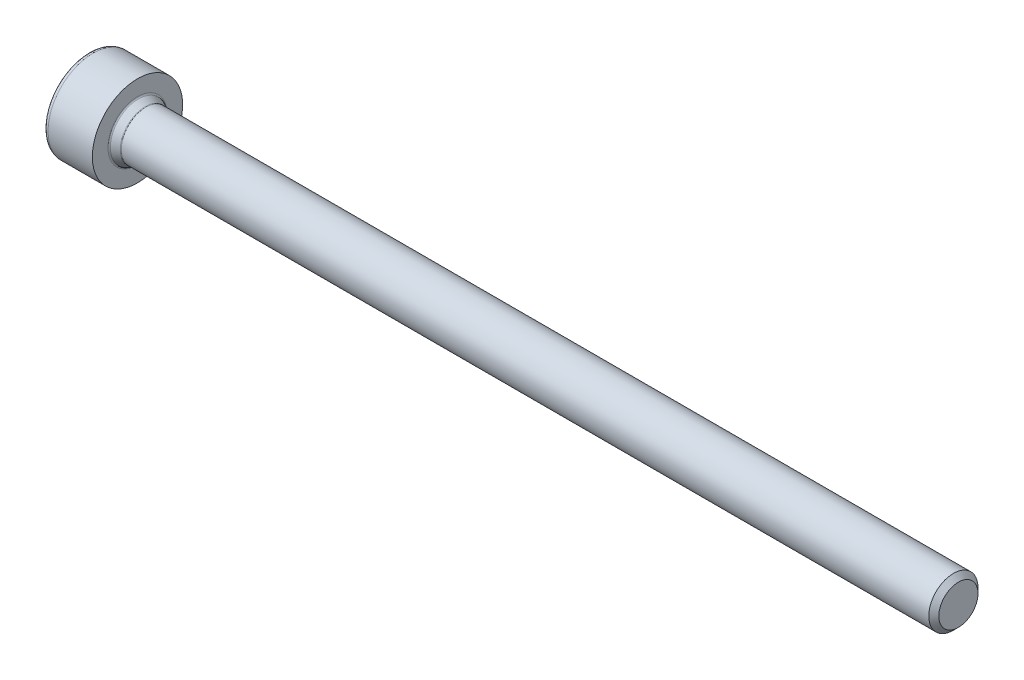
ISO-10303-21;
HEADER;
FILE_DESCRIPTION(('STEP AP214'),'2;1');
FILE_NAME('part.step','',(''),(''),'','','');
FILE_SCHEMA(('AUTOMOTIVE_DESIGN { 1 0 10303 214 1 1 1 1 }'));
ENDSEC;
DATA;
#1=APPLICATION_CONTEXT('core data for automotive mechanical design processes');
#2=APPLICATION_PROTOCOL_DEFINITION('international standard','automotive_design',2000,#1);
#3=PRODUCT_CONTEXT('',#1,'mechanical');
#4=PRODUCT('Part','Part','',(#3));
#5=PRODUCT_RELATED_PRODUCT_CATEGORY('part','',(#4));
#6=PRODUCT_DEFINITION_FORMATION('','',#4);
#7=PRODUCT_DEFINITION_CONTEXT('part definition',#1,'design');
#8=PRODUCT_DEFINITION('design','',#6,#7);
#9=PRODUCT_DEFINITION_SHAPE('','',#8);
#10=(LENGTH_UNIT() NAMED_UNIT(*) SI_UNIT(.MILLI.,.METRE.));
#11=(NAMED_UNIT(*) PLANE_ANGLE_UNIT() SI_UNIT($,.RADIAN.));
#12=(NAMED_UNIT(*) SI_UNIT($,.STERADIAN.) SOLID_ANGLE_UNIT());
#13=UNCERTAINTY_MEASURE_WITH_UNIT(LENGTH_MEASURE(1.E-05),#10,'distance_accuracy_value','');
#14=(GEOMETRIC_REPRESENTATION_CONTEXT(3) GLOBAL_UNCERTAINTY_ASSIGNED_CONTEXT((#13)) GLOBAL_UNIT_ASSIGNED_CONTEXT((#10,
#11,#12)) REPRESENTATION_CONTEXT('',''));
#15=CARTESIAN_POINT('',(0.,0.,0.));
#16=DIRECTION('',(0.,0.,1.));
#17=DIRECTION('',(1.,0.,0.));
#18=AXIS2_PLACEMENT_3D('',#15,#16,#17);
#19=CARTESIAN_POINT('',(-1.15,0.,0.));
#20=DIRECTION('',(1.,0.,0.));
#21=DIRECTION('',(0.,0.,-1.));
#22=AXIS2_PLACEMENT_3D('',#19,#20,#21);
#23=PLANE('',#22);
#24=DIRECTION('',(0.,1.,0.));
#25=VECTOR('',#24,1.);
#26=CARTESIAN_POINT('',(-1.15,0.721687836487032,1.25));
#27=LINE('',#26,#25);
#28=CARTESIAN_POINT('',(-1.15000000000217,0.,1.24999999998522));
#29=VERTEX_POINT('',#28);
#30=CARTESIAN_POINT('',(-1.15,0.721687836487032,1.25));
#31=VERTEX_POINT('',#30);
#32=EDGE_CURVE('E116',#29,#31,#27,.T.);
#33=ORIENTED_EDGE('',*,*,#32,.T.);
#34=DIRECTION('',(0.,-0.5,0.866025403784439));
#35=VECTOR('',#34,1.);
#36=CARTESIAN_POINT('',(-1.15,1.44337567297406,0.));
#37=LINE('',#36,#35);
#38=CARTESIAN_POINT('',(-1.15000000000217,1.08253175471775,0.624999999992611));
#39=VERTEX_POINT('',#38);
#40=EDGE_CURVE('E386',#31,#39,#37,.F.);
#41=ORIENTED_EDGE('',*,*,#40,.T.);
#42=CARTESIAN_POINT('',(-1.15000000000434,0.,0.));
#43=DIRECTION('',(-1.,0.,0.));
#44=DIRECTION('',(0.,0.,1.));
#45=AXIS2_PLACEMENT_3D('',#42,#43,#44);
#46=CIRCLE('',#45,1.24999999997044);
#47=EDGE_CURVE('E138',#29,#39,#46,.T.);
#48=ORIENTED_EDGE('',*,*,#47,.F.);
#49=EDGE_LOOP('',(#33,#41,#48));
#50=FACE_BOUND('',#49,.T.);
#51=ADVANCED_FACE('F16',(#50),#23,.F.);
#52=CARTESIAN_POINT('',(-1.15,0.,0.));
#53=DIRECTION('',(1.,0.,0.));
#54=DIRECTION('',(0.,0.,-1.));
#55=AXIS2_PLACEMENT_3D('',#52,#53,#54);
#56=PLANE('',#55);
#57=DIRECTION('',(0.,-0.5,-0.866025403784439));
#58=VECTOR('',#57,1.);
#59=CARTESIAN_POINT('',(-1.15,-0.721687836487032,1.25));
#60=LINE('',#59,#58);
#61=CARTESIAN_POINT('',(-1.15000000000217,-1.08253175471775,0.62499999999261));
#62=VERTEX_POINT('',#61);
#63=CARTESIAN_POINT('',(-1.15,-0.721687836487032,1.25));
#64=VERTEX_POINT('',#63);
#65=EDGE_CURVE('E364',#62,#64,#60,.F.);
#66=ORIENTED_EDGE('',*,*,#65,.T.);
#67=DIRECTION('',(0.,1.,0.));
#68=VECTOR('',#67,1.);
#69=CARTESIAN_POINT('',(-1.15,0.721687836487032,1.25));
#70=LINE('',#69,#68);
#71=EDGE_CURVE('E397',#64,#29,#70,.T.);
#72=ORIENTED_EDGE('',*,*,#71,.T.);
#73=CARTESIAN_POINT('',(-1.15000000000434,0.,0.));
#74=DIRECTION('',(-1.,0.,0.));
#75=DIRECTION('',(0.,0.,1.));
#76=AXIS2_PLACEMENT_3D('',#73,#74,#75);
#77=CIRCLE('',#76,1.24999999997044);
#78=EDGE_CURVE('E520',#62,#29,#77,.T.);
#79=ORIENTED_EDGE('',*,*,#78,.F.);
#80=EDGE_LOOP('',(#66,#72,#79));
#81=FACE_BOUND('',#80,.T.);
#82=ADVANCED_FACE('F518',(#81),#56,.F.);
#83=CARTESIAN_POINT('',(-1.15,0.721687836487032,1.25));
#84=DIRECTION('',(0.,0.,1.));
#85=DIRECTION('',(1.,0.,0.));
#86=AXIS2_PLACEMENT_3D('',#83,#84,#85);
#87=PLANE('',#86);
#88=DIRECTION('',(0.,1.,0.));
#89=VECTOR('',#88,1.);
#90=CARTESIAN_POINT('',(-3.,0.721687836487032,1.25));
#91=LINE('',#90,#89);
#92=CARTESIAN_POINT('',(-3.,0.721687836487032,1.25));
#93=VERTEX_POINT('',#92);
#94=CARTESIAN_POINT('',(-2.99999999999295,0.704787201971731,1.25));
#95=VERTEX_POINT('',#94);
#96=EDGE_CURVE('E101',#93,#95,#91,.F.);
#97=ORIENTED_EDGE('',*,*,#96,.F.);
#98=DIRECTION('',(1.,0.,0.));
#99=VECTOR('',#98,1.);
#100=CARTESIAN_POINT('',(-1.15,0.721687836487032,1.25));
#101=LINE('',#100,#99);
#102=EDGE_CURVE('E130',#93,#31,#101,.T.);
#103=ORIENTED_EDGE('',*,*,#102,.T.);
#104=ORIENTED_EDGE('',*,*,#32,.F.);
#105=ORIENTED_EDGE('',*,*,#71,.F.);
#106=DIRECTION('',(1.,0.,0.));
#107=VECTOR('',#106,1.);
#108=CARTESIAN_POINT('',(-1.15,-0.721687836487032,1.25));
#109=LINE('',#108,#107);
#110=CARTESIAN_POINT('',(-3.,-0.721687836487032,1.25));
#111=VERTEX_POINT('',#110);
#112=EDGE_CURVE('E353',#64,#111,#109,.F.);
#113=ORIENTED_EDGE('',*,*,#112,.T.);
#114=DIRECTION('',(0.,1.,0.));
#115=VECTOR('',#114,1.);
#116=CARTESIAN_POINT('',(-3.,0.721687836487032,1.25));
#117=LINE('',#116,#115);
#118=CARTESIAN_POINT('',(-2.99999999998205,-0.704787201949539,1.25));
#119=VERTEX_POINT('',#118);
#120=EDGE_CURVE('E126',#119,#111,#117,.F.);
#121=ORIENTED_EDGE('',*,*,#120,.F.);
#122=CARTESIAN_POINT('',(-2.99999999997783,0.704787201940949,1.25));
#123=CARTESIAN_POINT('',(-2.97628521463078,0.656463620376796,1.25));
#124=CARTESIAN_POINT('',(-2.95399453159109,0.607346612487099,1.25));
#125=CARTESIAN_POINT('',(-2.91320818106702,0.50722905890054,1.25));
#126=CARTESIAN_POINT('',(-2.89473623110118,0.456218934082642,1.25));
#127=CARTESIAN_POINT('',(-2.86290698911908,0.352798361194839,1.25));
#128=CARTESIAN_POINT('',(-2.84953056234284,0.300393958647145,1.25));
#129=CARTESIAN_POINT('',(-2.82898027873832,0.194487441725681,1.25));
#130=CARTESIAN_POINT('',(-2.82178823974678,0.140989021878624,1.25));
#131=CARTESIAN_POINT('',(-2.81703078816066,0.0727567227844202,1.25));
#132=CARTESIAN_POINT('',(-2.81627010165245,0.0582126032396365,1.25));
#133=CARTESIAN_POINT('',(-2.81525458538961,0.0291129972132385,1.25));
#134=CARTESIAN_POINT('',(-2.81499952617929,0.014557518887728,1.25));
#135=CARTESIAN_POINT('',(-2.8150012347011,-0.0379377877025189,1.25));
#136=CARTESIAN_POINT('',(-2.81673793609719,-0.0758894339973961,1.25));
#137=CARTESIAN_POINT('',(-2.82358164399023,-0.151496586555986,1.25));
#138=CARTESIAN_POINT('',(-2.82869102648729,-0.189151865095187,1.25));
#139=CARTESIAN_POINT('',(-2.8487554678,-0.301599972661582,1.25));
#140=CARTESIAN_POINT('',(-2.86844359296393,-0.375574474615493,1.25));
#141=CARTESIAN_POINT('',(-2.90770920227286,-0.492061542976807,1.25));
#142=CARTESIAN_POINT('',(-2.92436216211905,-0.535638893490145,1.25));
#143=CARTESIAN_POINT('',(-2.96033907938831,-0.62124460112848,1.25));
#144=CARTESIAN_POINT('',(-2.97963888445316,-0.663283043120013,1.25));
#145=CARTESIAN_POINT('',(-2.9999999999782,-0.704787201941698,1.25));
#146=B_SPLINE_CURVE_WITH_KNOTS('',3,(#122,#123,#124,#125,#126,#127,#128,#129,#130,#131,#132,
#133,#134,#135,#136,#137,#138,#139,#140,#141,#142,#143,#144,#145),.UNSPECIFIED.,.F.,.F.,(4,2,2,
2,2,2,2,2,2,2,2,4),(0.,0.161592976400067,0.324161275584256,0.486112933094178,0.64758680702521,
0.691272786946022,0.734938937452249,0.848735605721592,0.962612527612491,1.19125625258041,
1.33113310641346,1.46980937840027),.UNSPECIFIED.);
#147=EDGE_CURVE('E19',#95,#119,#146,.T.);
#148=ORIENTED_EDGE('',*,*,#147,.F.);
#149=EDGE_LOOP('',(#97,#103,#104,#105,#113,#121,#148));
#150=FACE_BOUND('',#149,.T.);
#151=ADVANCED_FACE('F124',(#150),#87,.F.);
#152=CARTESIAN_POINT('',(-1.15,1.44337567297406,0.));
#153=DIRECTION('',(0.,0.866025403784439,0.5));
#154=DIRECTION('',(0.,-0.5,0.866025403784439));
#155=AXIS2_PLACEMENT_3D('',#152,#153,#154);
#156=PLANE('',#155);
#157=DIRECTION('',(1.,0.,0.));
#158=VECTOR('',#157,1.);
#159=CARTESIAN_POINT('',(-1.15,1.44337567297406,0.));
#160=LINE('',#159,#158);
#161=CARTESIAN_POINT('',(-3.,1.44337567297406,0.));
#162=VERTEX_POINT('',#161);
#163=CARTESIAN_POINT('',(-1.15,1.44337567297406,0.));
#164=VERTEX_POINT('',#163);
#165=EDGE_CURVE('E344',#162,#164,#160,.T.);
#166=ORIENTED_EDGE('',*,*,#165,.T.);
#167=DIRECTION('',(0.,-0.5,0.866025403784439));
#168=VECTOR('',#167,1.);
#169=CARTESIAN_POINT('',(-1.15,1.44337567297406,0.));
#170=LINE('',#169,#168);
#171=EDGE_CURVE('E374',#164,#39,#170,.T.);
#172=ORIENTED_EDGE('',*,*,#171,.T.);
#173=ORIENTED_EDGE('',*,*,#40,.F.);
#174=ORIENTED_EDGE('',*,*,#102,.F.);
#175=DIRECTION('',(0.,-0.5,0.866025403784439));
#176=VECTOR('',#175,1.);
#177=CARTESIAN_POINT('',(-3.,1.44337567297406,0.));
#178=LINE('',#177,#176);
#179=CARTESIAN_POINT('',(-2.99999999998205,0.730138153755779,1.23536362115045));
#180=VERTEX_POINT('',#179);
#181=EDGE_CURVE('E111',#180,#93,#178,.T.);
#182=ORIENTED_EDGE('',*,*,#181,.F.);
#183=CARTESIAN_POINT('',(-2.9999999999782,1.4349253557014,0.0146363788563366));
#184=CARTESIAN_POINT('',(-2.9762852146311,1.4107635649193,0.0564858280927792));
#185=CARTESIAN_POINT('',(-2.95399453159138,1.38620506097443,0.099022404683175));
#186=CARTESIAN_POINT('',(-2.91320818106724,1.3361462841811,0.185726749453963));
#187=CARTESIAN_POINT('',(-2.89473623110136,1.31064122177213,0.229902813396519));
#188=CARTESIAN_POINT('',(-2.86290698911919,1.25893093532818,0.319467656791381));
#189=CARTESIAN_POINT('',(-2.84953056234293,1.23272873405431,0.364851200667875));
#190=CARTESIAN_POINT('',(-2.82898027873836,1.17977547559352,0.456568934748281));
#191=CARTESIAN_POINT('',(-2.8217882397468,1.15302626566997,0.502899925398206));
#192=CARTESIAN_POINT('',(-2.81703078816067,1.11891011612282,0.561990829772475));
#193=CARTESIAN_POINT('',(-2.81627010165245,1.11163805635042,0.574586406773958));
#194=CARTESIAN_POINT('',(-2.81525458538961,1.09708825333719,0.599787404832984));
#195=CARTESIAN_POINT('',(-2.81499952617929,1.08981051417443,0.612392818827132));
#196=CARTESIAN_POINT('',(-2.8150012347011,1.06356286087929,0.657855087913762));
#197=CARTESIAN_POINT('',(-2.81673793609719,1.04458703773185,0.690722177720568));
#198=CARTESIAN_POINT('',(-2.82358164399023,1.00678346145256,0.756199892544112));
#199=CARTESIAN_POINT('',(-2.82869102648729,0.987955822182955,0.788810320345639));
#200=CARTESIAN_POINT('',(-2.8487554678,0.931731768399757,0.886193238105623));
#201=CARTESIAN_POINT('',(-2.86844359296393,0.894744517422802,0.950257036030011));
#202=CARTESIAN_POINT('',(-2.90770920227286,0.836500983242145,1.05113779644328));
#203=CARTESIAN_POINT('',(-2.92436216211905,0.814712307985476,1.08887688901745));
#204=CARTESIAN_POINT('',(-2.96033907938831,0.771909454166308,1.16301360654119));
#205=CARTESIAN_POINT('',(-2.97963888445316,0.750890233170542,1.19941996524138));
#206=CARTESIAN_POINT('',(-2.9999999999782,0.7301381537597,1.23536362114366));
#207=B_SPLINE_CURVE_WITH_KNOTS('',3,(#183,#184,#185,#186,#187,#188,#189,#190,#191,#192,#193,
#194,#195,#196,#197,#198,#199,#200,#201,#202,#203,#204,#205,#206),.UNSPECIFIED.,.F.,.F.,(4,2,2,
2,2,2,2,2,2,2,2,4),(0.,0.161592976400233,0.324161275584591,0.486112933094683,0.647586807025883,
0.691272786946774,0.734938937453082,0.848735605722425,0.962612527613324,1.19125625258124,
1.33113310641429,1.4698093784011),.UNSPECIFIED.);
#208=CARTESIAN_POINT('',(-2.99999999999295,1.43492535571641,0.0146363788303264));
#209=VERTEX_POINT('',#208);
#210=EDGE_CURVE('E127',#209,#180,#207,.T.);
#211=ORIENTED_EDGE('',*,*,#210,.F.);
#212=DIRECTION('',(0.,-0.5,0.866025403784439));
#213=VECTOR('',#212,1.);
#214=CARTESIAN_POINT('',(-3.,1.44337567297406,0.));
#215=LINE('',#214,#213);
#216=EDGE_CURVE('E377',#162,#209,#215,.T.);
#217=ORIENTED_EDGE('',*,*,#216,.F.);
#218=EDGE_LOOP('',(#166,#172,#173,#174,#182,#211,#217));
#219=FACE_BOUND('',#218,.T.);
#220=ADVANCED_FACE('F140',(#219),#156,.F.);
#221=CARTESIAN_POINT('',(-1.15,0.,0.));
#222=DIRECTION('',(1.,0.,0.));
#223=DIRECTION('',(0.,0.,-1.));
#224=AXIS2_PLACEMENT_3D('',#221,#222,#223);
#225=PLANE('',#224);
#226=ORIENTED_EDGE('',*,*,#171,.F.);
#227=DIRECTION('',(0.,0.5,0.866025403784439));
#228=VECTOR('',#227,1.);
#229=CARTESIAN_POINT('',(-1.15,0.721687836487032,-1.25));
#230=LINE('',#229,#228);
#231=CARTESIAN_POINT('',(-1.15000000000217,1.08253175471775,-0.62499999999261));
#232=VERTEX_POINT('',#231);
#233=EDGE_CURVE('E339',#164,#232,#230,.F.);
#234=ORIENTED_EDGE('',*,*,#233,.T.);
#235=CARTESIAN_POINT('',(-1.15000000000434,0.,0.));
#236=DIRECTION('',(-1.,0.,0.));
#237=DIRECTION('',(0.,0.,1.));
#238=AXIS2_PLACEMENT_3D('',#235,#236,#237);
#239=CIRCLE('',#238,1.24999999997044);
#240=EDGE_CURVE('E526',#39,#232,#239,.T.);
#241=ORIENTED_EDGE('',*,*,#240,.F.);
#242=EDGE_LOOP('',(#226,#234,#241));
#243=FACE_BOUND('',#242,.T.);
#244=ADVANCED_FACE('F193',(#243),#225,.F.);
#245=CARTESIAN_POINT('',(-0.428312163535338,0.,0.));
#246=DIRECTION('',(-1.,0.,0.));
#247=DIRECTION('',(0.,0.,1.));
#248=AXIS2_PLACEMENT_3D('',#245,#246,#247);
#249=CONICAL_SURFACE('',#248,0.,1.04719755119718);
#250=CARTESIAN_POINT('',(-0.428312163478495,0.,8.5265128291212E-11));
#251=VERTEX_POINT('',#250);
#252=VERTEX_LOOP('',#251);
#253=FACE_BOUND('',#252,.T.);
#254=CARTESIAN_POINT('',(-1.15000000000434,0.,0.));
#255=DIRECTION('',(-1.,0.,0.));
#256=DIRECTION('',(0.,0.,1.));
#257=AXIS2_PLACEMENT_3D('',#254,#255,#256);
#258=CIRCLE('',#257,1.24999999997044);
#259=CARTESIAN_POINT('',(-1.15000000000217,-1.08253175471775,-0.62499999999261));
#260=VERTEX_POINT('',#259);
#261=EDGE_CURVE('E525',#260,#62,#258,.T.);
#262=ORIENTED_EDGE('',*,*,#261,.T.);
#263=ORIENTED_EDGE('',*,*,#78,.T.);
#264=ORIENTED_EDGE('',*,*,#47,.T.);
#265=ORIENTED_EDGE('',*,*,#240,.T.);
#266=CARTESIAN_POINT('',(-1.15000000000434,0.,0.));
#267=DIRECTION('',(-1.,0.,0.));
#268=DIRECTION('',(0.,0.,1.));
#269=AXIS2_PLACEMENT_3D('',#266,#267,#268);
#270=CIRCLE('',#269,1.24999999997044);
#271=CARTESIAN_POINT('',(-1.15000000000217,0.,-1.24999999998522));
#272=VERTEX_POINT('',#271);
#273=EDGE_CURVE('E167',#232,#272,#270,.T.);
#274=ORIENTED_EDGE('',*,*,#273,.T.);
#275=CARTESIAN_POINT('',(-1.15000000000434,0.,0.));
#276=DIRECTION('',(-1.,0.,0.));
#277=DIRECTION('',(0.,0.,1.));
#278=AXIS2_PLACEMENT_3D('',#275,#276,#277);
#279=CIRCLE('',#278,1.24999999997044);
#280=EDGE_CURVE('E461',#272,#260,#279,.T.);
#281=ORIENTED_EDGE('',*,*,#280,.T.);
#282=EDGE_LOOP('',(#262,#263,#264,#265,#274,#281));
#283=FACE_BOUND('',#282,.T.);
#284=ADVANCED_FACE('F190',(#253,#283),#249,.F.);
#285=CARTESIAN_POINT('',(-1.15,0.,0.));
#286=DIRECTION('',(1.,0.,0.));
#287=DIRECTION('',(0.,0.,-1.));
#288=AXIS2_PLACEMENT_3D('',#285,#286,#287);
#289=PLANE('',#288);
#290=DIRECTION('',(0.,0.5,-0.866025403784439));
#291=VECTOR('',#290,1.);
#292=CARTESIAN_POINT('',(-1.15,-1.44337567297406,0.));
#293=LINE('',#292,#291);
#294=CARTESIAN_POINT('',(-1.15,-1.44337567297406,0.));
#295=VERTEX_POINT('',#294);
#296=EDGE_CURVE('E315',#260,#295,#293,.F.);
#297=ORIENTED_EDGE('',*,*,#296,.T.);
#298=DIRECTION('',(0.,-0.5,-0.866025403784439));
#299=VECTOR('',#298,1.);
#300=CARTESIAN_POINT('',(-1.15,-0.721687836487032,1.25));
#301=LINE('',#300,#299);
#302=EDGE_CURVE('E359',#295,#62,#301,.F.);
#303=ORIENTED_EDGE('',*,*,#302,.T.);
#304=ORIENTED_EDGE('',*,*,#261,.F.);
#305=EDGE_LOOP('',(#297,#303,#304));
#306=FACE_BOUND('',#305,.T.);
#307=ADVANCED_FACE('F186',(#306),#289,.F.);
#308=CARTESIAN_POINT('',(-1.15,-0.721687836487032,1.25));
#309=DIRECTION('',(0.,-0.866025403784439,0.5));
#310=DIRECTION('',(0.,-0.5,-0.866025403784439));
#311=AXIS2_PLACEMENT_3D('',#308,#309,#310);
#312=PLANE('',#311);
#313=ORIENTED_EDGE('',*,*,#112,.F.);
#314=ORIENTED_EDGE('',*,*,#65,.F.);
#315=ORIENTED_EDGE('',*,*,#302,.F.);
#316=DIRECTION('',(1.,0.,0.));
#317=VECTOR('',#316,1.);
#318=CARTESIAN_POINT('',(-1.15,-1.44337567297406,0.));
#319=LINE('',#318,#317);
#320=CARTESIAN_POINT('',(-3.,-1.44337567297406,0.));
#321=VERTEX_POINT('',#320);
#322=EDGE_CURVE('E303',#295,#321,#319,.F.);
#323=ORIENTED_EDGE('',*,*,#322,.T.);
#324=DIRECTION('',(0.,-0.5,-0.866025403784439));
#325=VECTOR('',#324,1.);
#326=CARTESIAN_POINT('',(-3.,-0.721687836487032,1.25));
#327=LINE('',#326,#325);
#328=CARTESIAN_POINT('',(-2.99999999998205,-1.43492535570532,0.0146363788495459));
#329=VERTEX_POINT('',#328);
#330=EDGE_CURVE('E356',#329,#321,#327,.T.);
#331=ORIENTED_EDGE('',*,*,#330,.F.);
#332=CARTESIAN_POINT('',(-2.99999999997783,-0.730138153760074,1.23536362114302));
#333=CARTESIAN_POINT('',(-2.97628521463078,-0.75429994454215,1.19351417190661));
#334=CARTESIAN_POINT('',(-2.95399453159109,-0.778858448486999,1.15097759531625));
#335=CARTESIAN_POINT('',(-2.91320818106702,-0.828917225280278,1.06427325054554));
#336=CARTESIAN_POINT('',(-2.89473623110118,-0.854422287689228,1.02009718660303));
#337=CARTESIAN_POINT('',(-2.86290698911908,-0.906132574133129,0.930532343208248));
#338=CARTESIAN_POINT('',(-2.84953056234284,-0.932334775406976,0.885148799331799));
#339=CARTESIAN_POINT('',(-2.82898027873832,-0.985288033867708,0.793431065251485));
#340=CARTESIAN_POINT('',(-2.82178823974678,-1.01203724379124,0.747100074601607));
#341=CARTESIAN_POINT('',(-2.81703078816066,-1.04615339333834,0.688009170227409));
#342=CARTESIAN_POINT('',(-2.81627010165245,-1.05342545311073,0.675413593225949));
#343=CARTESIAN_POINT('',(-2.81525458538961,-1.06797525612393,0.65021259516697));
#344=CARTESIAN_POINT('',(-2.81499952617929,-1.07525299528668,0.637607181172844));
#345=CARTESIAN_POINT('',(-2.8150012347011,-1.10150064858181,0.592144912086237));
#346=CARTESIAN_POINT('',(-2.81673793609719,-1.12047647172925,0.559277822279432));
#347=CARTESIAN_POINT('',(-2.82358164399023,-1.15828004800854,0.493800107455888));
#348=CARTESIAN_POINT('',(-2.82869102648729,-1.17710768727814,0.46118967965436));
#349=CARTESIAN_POINT('',(-2.8487554678,-1.23333174106134,0.363806761894377));
#350=CARTESIAN_POINT('',(-2.86844359296393,-1.2703189920383,0.299742963969988));
#351=CARTESIAN_POINT('',(-2.90770920227286,-1.32856252621895,0.198862203556716));
#352=CARTESIAN_POINT('',(-2.92436216211905,-1.35035120147562,0.161123110982547));
#353=CARTESIAN_POINT('',(-2.96033907938831,-1.39315405529479,0.0869863934588053));
#354=CARTESIAN_POINT('',(-2.97963888445316,-1.41417327629056,0.0505800347586189));
#355=CARTESIAN_POINT('',(-2.9999999999782,-1.4349253557014,0.0146363788563364));
#356=B_SPLINE_CURVE_WITH_KNOTS('',3,(#332,#333,#334,#335,#336,#337,#338,#339,#340,#341,#342,
#343,#344,#345,#346,#347,#348,#349,#350,#351,#352,#353,#354,#355),.UNSPECIFIED.,.F.,.F.,(4,2,2,
2,2,2,2,2,2,2,2,4),(0.,0.161592976400068,0.324161275584257,0.486112933094179,0.647586807025211,
0.691272786946022,0.734938937452249,0.848735605721592,0.962612527612492,1.19125625258041,
1.33113310641346,1.46980937840027),.UNSPECIFIED.);
#357=CARTESIAN_POINT('',(-2.99999999999295,-0.730138153744683,1.23536362116967));
#358=VERTEX_POINT('',#357);
#359=EDGE_CURVE('E169',#358,#329,#356,.T.);
#360=ORIENTED_EDGE('',*,*,#359,.F.);
#361=DIRECTION('',(0.,-0.5,-0.866025403784439));
#362=VECTOR('',#361,1.);
#363=CARTESIAN_POINT('',(-3.,-0.721687836487032,1.25));
#364=LINE('',#363,#362);
#365=EDGE_CURVE('E166',#111,#358,#364,.T.);
#366=ORIENTED_EDGE('',*,*,#365,.F.);
#367=EDGE_LOOP('',(#313,#314,#315,#323,#331,#360,#366));
#368=FACE_BOUND('',#367,.T.);
#369=ADVANCED_FACE('F180',(#368),#312,.F.);
#370=CARTESIAN_POINT('',(-1.15,0.721687836487032,-1.25));
#371=DIRECTION('',(0.,0.866025403784439,-0.5));
#372=DIRECTION('',(0.,0.5,0.866025403784439));
#373=AXIS2_PLACEMENT_3D('',#370,#371,#372);
#374=PLANE('',#373);
#375=DIRECTION('',(-1.,0.,0.));
#376=VECTOR('',#375,1.);
#377=CARTESIAN_POINT('',(-1.15,0.721687836487032,-1.25));
#378=LINE('',#377,#376);
#379=CARTESIAN_POINT('',(-3.,0.721687836487032,-1.25));
#380=VERTEX_POINT('',#379);
#381=CARTESIAN_POINT('',(-1.15,0.721687836487032,-1.25));
#382=VERTEX_POINT('',#381);
#383=EDGE_CURVE('E292',#380,#382,#378,.F.);
#384=ORIENTED_EDGE('',*,*,#383,.T.);
#385=DIRECTION('',(0.,0.5,0.866025403784438));
#386=VECTOR('',#385,1.);
#387=CARTESIAN_POINT('',(-1.15,0.721687836487032,-1.25));
#388=LINE('',#387,#386);
#389=EDGE_CURVE('E327',#382,#232,#388,.T.);
#390=ORIENTED_EDGE('',*,*,#389,.T.);
#391=ORIENTED_EDGE('',*,*,#233,.F.);
#392=ORIENTED_EDGE('',*,*,#165,.F.);
#393=DIRECTION('',(0.,0.5,0.866025403784439));
#394=VECTOR('',#393,1.);
#395=CARTESIAN_POINT('',(-3.,0.721687836487032,-1.25));
#396=LINE('',#395,#394);
#397=CARTESIAN_POINT('',(-2.99999999998205,1.43492535570532,-0.014636378849546));
#398=VERTEX_POINT('',#397);
#399=EDGE_CURVE('E165',#398,#162,#396,.T.);
#400=ORIENTED_EDGE('',*,*,#399,.F.);
#401=CARTESIAN_POINT('',(-2.9999999999782,0.7301381537597,-1.23536362114366));
#402=CARTESIAN_POINT('',(-2.9762852146311,0.754299944541797,-1.19351417190722));
#403=CARTESIAN_POINT('',(-2.95399453159138,0.778858448486668,-1.15097759531682));
#404=CARTESIAN_POINT('',(-2.91320818106724,0.828917225279992,-1.06427325054604));
#405=CARTESIAN_POINT('',(-2.89473623110136,0.854422287688965,-1.02009718660348));
#406=CARTESIAN_POINT('',(-2.86290698911919,0.906132574132916,-0.930532343208618));
#407=CARTESIAN_POINT('',(-2.84953056234293,0.932334775406789,-0.885148799332124));
#408=CARTESIAN_POINT('',(-2.82898027873836,0.985288033867573,-0.793431065251719));
#409=CARTESIAN_POINT('',(-2.8217882397468,1.01203724379113,-0.747100074601794));
#410=CARTESIAN_POINT('',(-2.81703078816067,1.04615339333827,-0.688009170227525));
#411=CARTESIAN_POINT('',(-2.81627010165245,1.05342545311068,-0.675413593226042));
#412=CARTESIAN_POINT('',(-2.81525458538961,1.0679752561239,-0.650212595167016));
#413=CARTESIAN_POINT('',(-2.81499952617929,1.07525299528667,-0.637607181172867));
#414=CARTESIAN_POINT('',(-2.8150012347011,1.10150064858181,-0.592144912086238));
#415=CARTESIAN_POINT('',(-2.81673793609719,1.12047647172925,-0.559277822279432));
#416=CARTESIAN_POINT('',(-2.82358164399023,1.15828004800854,-0.493800107455888));
#417=CARTESIAN_POINT('',(-2.82869102648729,1.17710768727814,-0.461189679654361));
#418=CARTESIAN_POINT('',(-2.8487554678,1.23333174106134,-0.363806761894377));
#419=CARTESIAN_POINT('',(-2.86844359296393,1.2703189920383,-0.299742963969989));
#420=CARTESIAN_POINT('',(-2.90770920227286,1.32856252621895,-0.198862203556717));
#421=CARTESIAN_POINT('',(-2.92436216211905,1.35035120147562,-0.161123110982547));
#422=CARTESIAN_POINT('',(-2.96033907938831,1.39315405529479,-0.0869863934588057));
#423=CARTESIAN_POINT('',(-2.97963888445316,1.41417327629056,-0.0505800347586193));
#424=CARTESIAN_POINT('',(-2.9999999999782,1.4349253557014,-0.0146363788563367));
#425=B_SPLINE_CURVE_WITH_KNOTS('',3,(#401,#402,#403,#404,#405,#406,#407,#408,#409,#410,#411,
#412,#413,#414,#415,#416,#417,#418,#419,#420,#421,#422,#423,#424),.UNSPECIFIED.,.F.,.F.,(4,2,2,
2,2,2,2,2,2,2,2,4),(0.,0.161592976400233,0.324161275584592,0.486112933094683,0.647586807025883,
0.691272786946774,0.734938937453081,0.848735605722424,0.962612527613324,1.19125625258124,
1.33113310641429,1.4698093784011),.UNSPECIFIED.);
#426=CARTESIAN_POINT('',(-2.99999999999295,0.730138153744683,-1.23536362116967));
#427=VERTEX_POINT('',#426);
#428=EDGE_CURVE('E158',#427,#398,#425,.T.);
#429=ORIENTED_EDGE('',*,*,#428,.F.);
#430=DIRECTION('',(0.,0.5,0.866025403784439));
#431=VECTOR('',#430,1.);
#432=CARTESIAN_POINT('',(-3.,0.721687836487032,-1.25));
#433=LINE('',#432,#431);
#434=EDGE_CURVE('E330',#380,#427,#433,.T.);
#435=ORIENTED_EDGE('',*,*,#434,.F.);
#436=EDGE_LOOP('',(#384,#390,#391,#392,#400,#429,#435));
#437=FACE_BOUND('',#436,.T.);
#438=ADVANCED_FACE('F175',(#437),#374,.F.);
#439=CARTESIAN_POINT('',(-1.15,0.,0.));
#440=DIRECTION('',(1.,0.,0.));
#441=DIRECTION('',(0.,0.,-1.));
#442=AXIS2_PLACEMENT_3D('',#439,#440,#441);
#443=PLANE('',#442);
#444=ORIENTED_EDGE('',*,*,#389,.F.);
#445=DIRECTION('',(0.,1.,0.));
#446=VECTOR('',#445,1.);
#447=CARTESIAN_POINT('',(-1.15,-0.721687836487032,-1.25));
#448=LINE('',#447,#446);
#449=EDGE_CURVE('E320',#382,#272,#448,.F.);
#450=ORIENTED_EDGE('',*,*,#449,.T.);
#451=ORIENTED_EDGE('',*,*,#273,.F.);
#452=EDGE_LOOP('',(#444,#450,#451));
#453=FACE_BOUND('',#452,.T.);
#454=ADVANCED_FACE('F179',(#453),#443,.F.);
#455=CARTESIAN_POINT('',(-1.15,0.,0.));
#456=DIRECTION('',(1.,0.,0.));
#457=DIRECTION('',(0.,0.,-1.));
#458=AXIS2_PLACEMENT_3D('',#455,#456,#457);
#459=PLANE('',#458);
#460=DIRECTION('',(0.,1.,0.));
#461=VECTOR('',#460,1.);
#462=CARTESIAN_POINT('',(-1.15,-0.721687836487032,-1.25));
#463=LINE('',#462,#461);
#464=CARTESIAN_POINT('',(-1.15,-0.721687836487032,-1.25));
#465=VERTEX_POINT('',#464);
#466=EDGE_CURVE('E299',#272,#465,#463,.F.);
#467=ORIENTED_EDGE('',*,*,#466,.T.);
#468=DIRECTION('',(0.,0.5,-0.866025403784439));
#469=VECTOR('',#468,1.);
#470=CARTESIAN_POINT('',(-1.15,-1.44337567297406,0.));
#471=LINE('',#470,#469);
#472=EDGE_CURVE('E309',#465,#260,#471,.F.);
#473=ORIENTED_EDGE('',*,*,#472,.T.);
#474=ORIENTED_EDGE('',*,*,#280,.F.);
#475=EDGE_LOOP('',(#467,#473,#474));
#476=FACE_BOUND('',#475,.T.);
#477=ADVANCED_FACE('F449',(#476),#459,.F.);
#478=CARTESIAN_POINT('',(-1.15,-1.44337567297406,0.));
#479=DIRECTION('',(0.,-0.866025403784439,-0.5));
#480=DIRECTION('',(0.,0.5,-0.866025403784439));
#481=AXIS2_PLACEMENT_3D('',#478,#479,#480);
#482=PLANE('',#481);
#483=ORIENTED_EDGE('',*,*,#322,.F.);
#484=ORIENTED_EDGE('',*,*,#296,.F.);
#485=ORIENTED_EDGE('',*,*,#472,.F.);
#486=DIRECTION('',(-1.,0.,0.));
#487=VECTOR('',#486,1.);
#488=CARTESIAN_POINT('',(-1.15,-0.721687836487032,-1.25));
#489=LINE('',#488,#487);
#490=CARTESIAN_POINT('',(-3.,-0.721687836487032,-1.25));
#491=VERTEX_POINT('',#490);
#492=EDGE_CURVE('E296',#465,#491,#489,.T.);
#493=ORIENTED_EDGE('',*,*,#492,.T.);
#494=DIRECTION('',(0.,0.5,-0.866025403784439));
#495=VECTOR('',#494,1.);
#496=CARTESIAN_POINT('',(-3.,-1.44337567297406,0.));
#497=LINE('',#496,#495);
#498=CARTESIAN_POINT('',(-2.99999999998205,-0.730138153755779,-1.23536362115045));
#499=VERTEX_POINT('',#498);
#500=EDGE_CURVE('E306',#499,#491,#497,.T.);
#501=ORIENTED_EDGE('',*,*,#500,.F.);
#502=CARTESIAN_POINT('',(-2.99999999997783,-1.43492535570102,-0.0146363788569844));
#503=CARTESIAN_POINT('',(-2.97628521463078,-1.41076356491895,-0.0564858280933905));
#504=CARTESIAN_POINT('',(-2.95399453159109,-1.3862050609741,-0.0990224046837488));
#505=CARTESIAN_POINT('',(-2.91320818106702,-1.33614628418082,-0.185726749454458));
#506=CARTESIAN_POINT('',(-2.89473623110118,-1.31064122177187,-0.229902813396973));
#507=CARTESIAN_POINT('',(-2.86290698911908,-1.25893093532797,-0.319467656791751));
#508=CARTESIAN_POINT('',(-2.84953056234284,-1.23272873405412,-0.3648512006682));
#509=CARTESIAN_POINT('',(-2.82898027873832,-1.17977547559339,-0.456568934748514));
#510=CARTESIAN_POINT('',(-2.82178823974678,-1.15302626566986,-0.502899925398392));
#511=CARTESIAN_POINT('',(-2.81703078816066,-1.11891011612276,-0.56199082977259));
#512=CARTESIAN_POINT('',(-2.81627010165245,-1.11163805635037,-0.57458640677405));
#513=CARTESIAN_POINT('',(-2.81525458538961,-1.09708825333717,-0.59978740483303));
#514=CARTESIAN_POINT('',(-2.81499952617929,-1.08981051417441,-0.612392818827155));
#515=CARTESIAN_POINT('',(-2.8150012347011,-1.06356286087929,-0.657855087913762));
#516=CARTESIAN_POINT('',(-2.81673793609719,-1.04458703773185,-0.690722177720567));
#517=CARTESIAN_POINT('',(-2.82358164399023,-1.00678346145256,-0.756199892544111));
#518=CARTESIAN_POINT('',(-2.82869102648729,-0.987955822182955,-0.788810320345639));
#519=CARTESIAN_POINT('',(-2.8487554678,-0.931731768399757,-0.886193238105622));
#520=CARTESIAN_POINT('',(-2.86844359296393,-0.894744517422802,-0.950257036030011));
#521=CARTESIAN_POINT('',(-2.90770920227286,-0.836500983242145,-1.05113779644328));
#522=CARTESIAN_POINT('',(-2.92436216211905,-0.814712307985476,-1.08887688901745));
#523=CARTESIAN_POINT('',(-2.96033907938831,-0.771909454166309,-1.16301360654119));
#524=CARTESIAN_POINT('',(-2.97963888445316,-0.750890233170542,-1.19941996524138));
#525=CARTESIAN_POINT('',(-2.9999999999782,-0.730138153759699,-1.23536362114366));
#526=B_SPLINE_CURVE_WITH_KNOTS('',3,(#502,#503,#504,#505,#506,#507,#508,#509,#510,#511,#512,
#513,#514,#515,#516,#517,#518,#519,#520,#521,#522,#523,#524,#525),.UNSPECIFIED.,.F.,.F.,(4,2,2,
2,2,2,2,2,2,2,2,4),(0.,0.161592976400067,0.324161275584256,0.486112933094178,0.64758680702521,
0.691272786946021,0.734938937452249,0.848735605721592,0.962612527612491,1.19125625258041,
1.33113310641346,1.46980937840027),.UNSPECIFIED.);
#527=CARTESIAN_POINT('',(-2.99999999999295,-1.43492535571641,-0.0146363788303264));
#528=VERTEX_POINT('',#527);
#529=EDGE_CURVE('E310',#528,#499,#526,.T.);
#530=ORIENTED_EDGE('',*,*,#529,.F.);
#531=DIRECTION('',(0.,0.5,-0.866025403784439));
#532=VECTOR('',#531,1.);
#533=CARTESIAN_POINT('',(-3.,-1.44337567297406,0.));
#534=LINE('',#533,#532);
#535=EDGE_CURVE('E293',#321,#528,#534,.T.);
#536=ORIENTED_EDGE('',*,*,#535,.F.);
#537=EDGE_LOOP('',(#483,#484,#485,#493,#501,#530,#536));
#538=FACE_BOUND('',#537,.T.);
#539=ADVANCED_FACE('F445',(#538),#482,.F.);
#540=CARTESIAN_POINT('',(-1.15,-0.721687836487032,-1.25));
#541=DIRECTION('',(0.,0.,-1.));
#542=DIRECTION('',(-1.,0.,0.));
#543=AXIS2_PLACEMENT_3D('',#540,#541,#542);
#544=PLANE('',#543);
#545=ORIENTED_EDGE('',*,*,#492,.F.);
#546=ORIENTED_EDGE('',*,*,#466,.F.);
#547=ORIENTED_EDGE('',*,*,#449,.F.);
#548=ORIENTED_EDGE('',*,*,#383,.F.);
#549=DIRECTION('',(0.,1.,0.));
#550=VECTOR('',#549,1.);
#551=CARTESIAN_POINT('',(-3.,-0.721687836487032,-1.25));
#552=LINE('',#551,#550);
#553=CARTESIAN_POINT('',(-2.999999999989,0.704787201963686,-1.25));
#554=VERTEX_POINT('',#553);
#555=EDGE_CURVE('E284',#554,#380,#552,.T.);
#556=ORIENTED_EDGE('',*,*,#555,.F.);
#557=CARTESIAN_POINT('',(-2.99999999997763,-0.704787201940541,-1.25));
#558=CARTESIAN_POINT('',(-2.9762852146306,-0.656463620376411,-1.25));
#559=CARTESIAN_POINT('',(-2.95399453159093,-0.607346612486737,-1.25));
#560=CARTESIAN_POINT('',(-2.91320818106691,-0.507229058900227,-1.25));
#561=CARTESIAN_POINT('',(-2.89473623110109,-0.456218934082354,-1.25));
#562=CARTESIAN_POINT('',(-2.86290698911902,-0.352798361194605,-1.25));
#563=CARTESIAN_POINT('',(-2.84953056234279,-0.300393958646939,-1.25));
#564=CARTESIAN_POINT('',(-2.82898027873829,-0.194487441725533,-1.25));
#565=CARTESIAN_POINT('',(-2.82178823974677,-0.140989021878505,-1.25));
#566=CARTESIAN_POINT('',(-2.81703078816066,-0.0727567227843467,-1.25));
#567=CARTESIAN_POINT('',(-2.81627010165244,-0.0582126032395778,-1.25));
#568=CARTESIAN_POINT('',(-2.81525458538961,-0.0291129972132093,-1.25));
#569=CARTESIAN_POINT('',(-2.81499952617929,-0.0145575188877135,-1.25));
#570=CARTESIAN_POINT('',(-2.8150012347011,0.0379377877025188,-1.25));
#571=CARTESIAN_POINT('',(-2.81673793609719,0.0758894339973961,-1.25));
#572=CARTESIAN_POINT('',(-2.82358164399023,0.151496586555986,-1.25));
#573=CARTESIAN_POINT('',(-2.82869102648729,0.189151865095188,-1.25));
#574=CARTESIAN_POINT('',(-2.8487554678,0.301599972661583,-1.25));
#575=CARTESIAN_POINT('',(-2.86844359296393,0.375574474615493,-1.25));
#576=CARTESIAN_POINT('',(-2.90770920227284,0.492061542976734,-1.25));
#577=CARTESIAN_POINT('',(-2.92436216211899,0.535638893490002,-1.25));
#578=CARTESIAN_POINT('',(-2.96033907938818,0.621244601128201,-1.25));
#579=CARTESIAN_POINT('',(-2.979638884453,0.663283043119669,-1.25));
#580=CARTESIAN_POINT('',(-2.999999999978,0.70478720194129,-1.25));
#581=B_SPLINE_CURVE_WITH_KNOTS('',3,(#557,#558,#559,#560,#561,#562,#563,#564,#565,#566,#567,
#568,#569,#570,#571,#572,#573,#574,#575,#576,#577,#578,#579,#580),.UNSPECIFIED.,.F.,.F.,(4,2,2,
2,2,2,2,2,2,2,2,4),(0.,0.161592976399978,0.324161275584075,0.486112933093904,0.647586807024844,
0.691272786945611,0.734938937451794,0.848735605721138,0.962612527612037,1.19125625257995,
1.33113310641277,1.46980937839936),.UNSPECIFIED.);
#582=CARTESIAN_POINT('',(-2.99999999998177,-0.70478720194896,-1.25));
#583=VERTEX_POINT('',#582);
#584=EDGE_CURVE('E38',#583,#554,#581,.T.);
#585=ORIENTED_EDGE('',*,*,#584,.F.);
#586=DIRECTION('',(0.,1.,0.));
#587=VECTOR('',#586,1.);
#588=CARTESIAN_POINT('',(-3.,0.,-1.25));
#589=LINE('',#588,#587);
#590=EDGE_CURVE('E433',#491,#583,#589,.T.);
#591=ORIENTED_EDGE('',*,*,#590,.F.);
#592=EDGE_LOOP('',(#545,#546,#547,#548,#556,#585,#591));
#593=FACE_BOUND('',#592,.T.);
#594=ADVANCED_FACE('F442',(#593),#544,.F.);
#595=CARTESIAN_POINT('',(-2.81388999997034,0.,0.));
#596=DIRECTION('',(-1.,0.,0.));
#597=DIRECTION('',(0.,0.,1.));
#598=AXIS2_PLACEMENT_3D('',#595,#596,#597);
#599=CONICAL_SURFACE('',#598,1.24888999999939,0.785398163397448);
#600=CARTESIAN_POINT('',(-2.9999999999859,0.,0.));
#601=DIRECTION('',(-1.,0.,0.));
#602=DIRECTION('',(0.,0.,1.));
#603=AXIS2_PLACEMENT_3D('',#600,#601,#602);
#604=CIRCLE('',#603,1.43500000001495);
#605=EDGE_CURVE('E430',#583,#554,#604,.F.);
#606=ORIENTED_EDGE('',*,*,#605,.F.);
#607=ORIENTED_EDGE('',*,*,#584,.T.);
#608=EDGE_LOOP('',(#606,#607));
#609=FACE_BOUND('',#608,.T.);
#610=ADVANCED_FACE('F153',(#609),#599,.F.);
#611=CARTESIAN_POINT('',(-2.81388999997034,0.,0.));
#612=DIRECTION('',(-1.,0.,0.));
#613=DIRECTION('',(0.,0.,1.));
#614=AXIS2_PLACEMENT_3D('',#611,#612,#613);
#615=CONICAL_SURFACE('',#614,1.24888999999939,0.785398163397448);
#616=ORIENTED_EDGE('',*,*,#428,.T.);
#617=CARTESIAN_POINT('',(-2.9999999999859,0.,0.));
#618=DIRECTION('',(-1.,0.,0.));
#619=DIRECTION('',(0.,0.,1.));
#620=AXIS2_PLACEMENT_3D('',#617,#618,#619);
#621=CIRCLE('',#620,1.43500000001495);
#622=EDGE_CURVE('E427',#427,#398,#621,.F.);
#623=ORIENTED_EDGE('',*,*,#622,.F.);
#624=EDGE_LOOP('',(#616,#623));
#625=FACE_BOUND('',#624,.T.);
#626=ADVANCED_FACE('F147',(#625),#615,.F.);
#627=CARTESIAN_POINT('',(-2.81388999997034,0.,0.));
#628=DIRECTION('',(-1.,0.,0.));
#629=DIRECTION('',(0.,0.,1.));
#630=AXIS2_PLACEMENT_3D('',#627,#628,#629);
#631=CONICAL_SURFACE('',#630,1.24888999999939,0.785398163397448);
#632=ORIENTED_EDGE('',*,*,#210,.T.);
#633=CARTESIAN_POINT('',(-2.9999999999859,0.,0.));
#634=DIRECTION('',(-1.,0.,0.));
#635=DIRECTION('',(0.,0.,1.));
#636=AXIS2_PLACEMENT_3D('',#633,#634,#635);
#637=CIRCLE('',#636,1.43500000001495);
#638=EDGE_CURVE('E122',#209,#180,#637,.F.);
#639=ORIENTED_EDGE('',*,*,#638,.F.);
#640=EDGE_LOOP('',(#632,#639));
#641=FACE_BOUND('',#640,.T.);
#642=ADVANCED_FACE('F143',(#641),#631,.F.);
#643=CARTESIAN_POINT('',(-2.81388999997034,0.,0.));
#644=DIRECTION('',(-1.,0.,0.));
#645=DIRECTION('',(0.,0.,1.));
#646=AXIS2_PLACEMENT_3D('',#643,#644,#645);
#647=CONICAL_SURFACE('',#646,1.24888999999939,0.785398163397448);
#648=CARTESIAN_POINT('',(-2.9999999999859,0.,0.));
#649=DIRECTION('',(-1.,0.,0.));
#650=DIRECTION('',(0.,0.,1.));
#651=AXIS2_PLACEMENT_3D('',#648,#649,#650);
#652=CIRCLE('',#651,1.43500000001495);
#653=EDGE_CURVE('E107',#95,#119,#652,.F.);
#654=ORIENTED_EDGE('',*,*,#653,.F.);
#655=ORIENTED_EDGE('',*,*,#147,.T.);
#656=EDGE_LOOP('',(#654,#655));
#657=FACE_BOUND('',#656,.T.);
#658=ADVANCED_FACE('F120',(#657),#647,.F.);
#659=CARTESIAN_POINT('',(-2.81388999997034,0.,0.));
#660=DIRECTION('',(-1.,0.,0.));
#661=DIRECTION('',(0.,0.,1.));
#662=AXIS2_PLACEMENT_3D('',#659,#660,#661);
#663=CONICAL_SURFACE('',#662,1.24888999999939,0.785398163397448);
#664=CARTESIAN_POINT('',(-2.9999999999859,0.,0.));
#665=DIRECTION('',(-1.,0.,0.));
#666=DIRECTION('',(0.,0.,1.));
#667=AXIS2_PLACEMENT_3D('',#664,#665,#666);
#668=CIRCLE('',#667,1.43500000001495);
#669=EDGE_CURVE('E121',#358,#329,#668,.F.);
#670=ORIENTED_EDGE('',*,*,#669,.F.);
#671=ORIENTED_EDGE('',*,*,#359,.T.);
#672=EDGE_LOOP('',(#670,#671));
#673=FACE_BOUND('',#672,.T.);
#674=ADVANCED_FACE('F487',(#673),#663,.F.);
#675=CARTESIAN_POINT('',(-2.81388999997034,0.,0.));
#676=DIRECTION('',(-1.,0.,0.));
#677=DIRECTION('',(0.,0.,1.));
#678=AXIS2_PLACEMENT_3D('',#675,#676,#677);
#679=CONICAL_SURFACE('',#678,1.24888999999939,0.785398163397448);
#680=CARTESIAN_POINT('',(-2.9999999999859,0.,0.));
#681=DIRECTION('',(-1.,0.,0.));
#682=DIRECTION('',(0.,0.,1.));
#683=AXIS2_PLACEMENT_3D('',#680,#681,#682);
#684=CIRCLE('',#683,1.43500000001495);
#685=EDGE_CURVE('E421',#528,#499,#684,.F.);
#686=ORIENTED_EDGE('',*,*,#685,.F.);
#687=ORIENTED_EDGE('',*,*,#529,.T.);
#688=EDGE_LOOP('',(#686,#687));
#689=FACE_BOUND('',#688,.T.);
#690=ADVANCED_FACE('F485',(#689),#679,.F.);
#691=CARTESIAN_POINT('',(-3.,0.,-1.9425));
#692=DIRECTION('',(-1.,0.,0.));
#693=DIRECTION('',(0.,0.,1.));
#694=AXIS2_PLACEMENT_3D('',#691,#692,#693);
#695=PLANE('',#694);
#696=ORIENTED_EDGE('',*,*,#535,.T.);
#697=ORIENTED_EDGE('',*,*,#685,.T.);
#698=ORIENTED_EDGE('',*,*,#500,.T.);
#699=ORIENTED_EDGE('',*,*,#590,.T.);
#700=ORIENTED_EDGE('',*,*,#605,.T.);
#701=ORIENTED_EDGE('',*,*,#555,.T.);
#702=ORIENTED_EDGE('',*,*,#434,.T.);
#703=ORIENTED_EDGE('',*,*,#622,.T.);
#704=ORIENTED_EDGE('',*,*,#399,.T.);
#705=ORIENTED_EDGE('',*,*,#216,.T.);
#706=ORIENTED_EDGE('',*,*,#638,.T.);
#707=ORIENTED_EDGE('',*,*,#181,.T.);
#708=ORIENTED_EDGE('',*,*,#96,.T.);
#709=ORIENTED_EDGE('',*,*,#653,.T.);
#710=ORIENTED_EDGE('',*,*,#120,.T.);
#711=ORIENTED_EDGE('',*,*,#365,.T.);
#712=ORIENTED_EDGE('',*,*,#669,.T.);
#713=ORIENTED_EDGE('',*,*,#330,.T.);
#714=EDGE_LOOP('',(#696,#697,#698,#699,#700,#701,#702,#703,#704,#705,#706,#707,#708,#709,#710,
#711,#712,#713));
#715=FACE_BOUND('',#714,.T.);
#716=CARTESIAN_POINT('',(-3.,0.,0.));
#717=DIRECTION('',(1.,0.,0.));
#718=DIRECTION('',(0.,0.,-1.));
#719=AXIS2_PLACEMENT_3D('',#716,#717,#718);
#720=CIRCLE('',#719,2.45);
#721=CARTESIAN_POINT('',(-3.,0.,-2.45));
#722=VERTEX_POINT('',#721);
#723=EDGE_CURVE('E263',#722,#722,#720,.T.);
#724=ORIENTED_EDGE('',*,*,#723,.F.);
#725=EDGE_LOOP('',(#724));
#726=FACE_BOUND('',#725,.T.);
#727=ADVANCED_FACE('F104',(#715,#726),#695,.T.);
#728=CARTESIAN_POINT('',(-2.69999999999999,0.,0.));
#729=DIRECTION('',(-1.,0.,0.));
#730=DIRECTION('',(0.,0.,1.));
#731=AXIS2_PLACEMENT_3D('',#728,#729,#730);
#732=TOROIDAL_SURFACE('',#731,2.44999999999999,0.300000000000007);
#733=CARTESIAN_POINT('',(-2.7,0.,0.));
#734=DIRECTION('',(-1.,0.,0.));
#735=DIRECTION('',(0.,0.,1.));
#736=AXIS2_PLACEMENT_3D('',#733,#734,#735);
#737=CIRCLE('',#736,2.75);
#738=CARTESIAN_POINT('',(-2.7,0.,2.75));
#739=VERTEX_POINT('',#738);
#740=EDGE_CURVE('E254',#739,#739,#737,.F.);
#741=ORIENTED_EDGE('',*,*,#740,.F.);
#742=EDGE_LOOP('',(#741));
#743=FACE_BOUND('',#742,.T.);
#744=ORIENTED_EDGE('',*,*,#723,.T.);
#745=EDGE_LOOP('',(#744));
#746=FACE_BOUND('',#745,.T.);
#747=ADVANCED_FACE('F269',(#743,#746),#732,.T.);
#748=CARTESIAN_POINT('',(-1.35,0.,0.));
#749=DIRECTION('',(-1.,0.,0.));
#750=DIRECTION('',(0.,0.,1.));
#751=AXIS2_PLACEMENT_3D('',#748,#749,#750);
#752=CYLINDRICAL_SURFACE('',#751,2.75);
#753=ORIENTED_EDGE('',*,*,#740,.T.);
#754=EDGE_LOOP('',(#753));
#755=FACE_BOUND('',#754,.T.);
#756=CARTESIAN_POINT('',(0.,0.,0.));
#757=DIRECTION('',(-1.,0.,0.));
#758=DIRECTION('',(0.,0.,1.));
#759=AXIS2_PLACEMENT_3D('',#756,#757,#758);
#760=CIRCLE('',#759,2.75);
#761=CARTESIAN_POINT('',(0.,0.,2.75));
#762=VERTEX_POINT('',#761);
#763=EDGE_CURVE('E262',#762,#762,#760,.F.);
#764=ORIENTED_EDGE('',*,*,#763,.F.);
#765=EDGE_LOOP('',(#764));
#766=FACE_BOUND('',#765,.T.);
#767=ADVANCED_FACE('F273',(#755,#766),#752,.T.);
#768=CARTESIAN_POINT('',(0.,0.,-2.275));
#769=DIRECTION('',(1.,0.,0.));
#770=DIRECTION('',(0.,0.,-1.));
#771=AXIS2_PLACEMENT_3D('',#768,#769,#770);
#772=PLANE('',#771);
#773=CARTESIAN_POINT('',(0.,0.,0.));
#774=DIRECTION('',(1.,0.,0.));
#775=DIRECTION('',(0.,0.,-1.));
#776=AXIS2_PLACEMENT_3D('',#773,#774,#775);
#777=CIRCLE('',#776,1.8);
#778=CARTESIAN_POINT('',(0.,0.,-1.8));
#779=VERTEX_POINT('',#778);
#780=EDGE_CURVE('E232',#779,#779,#777,.T.);
#781=ORIENTED_EDGE('',*,*,#780,.F.);
#782=EDGE_LOOP('',(#781));
#783=FACE_BOUND('',#782,.T.);
#784=ORIENTED_EDGE('',*,*,#763,.T.);
#785=EDGE_LOOP('',(#784));
#786=FACE_BOUND('',#785,.T.);
#787=ADVANCED_FACE('F244',(#783,#786),#772,.T.);
#788=CARTESIAN_POINT('',(0.0999999999999986,0.,0.));
#789=DIRECTION('',(-1.,0.,0.));
#790=DIRECTION('',(0.,0.,1.));
#791=AXIS2_PLACEMENT_3D('',#788,#789,#790);
#792=TOROIDAL_SURFACE('',#791,1.8,0.0999999999999986);
#793=CARTESIAN_POINT('',(0.0561576367772432,0.,0.));
#794=DIRECTION('',(-1.,0.,0.));
#795=DIRECTION('',(0.,0.,-1.));
#796=AXIS2_PLACEMENT_3D('',#793,#794,#795);
#797=CIRCLE('',#796,1.71012315544772);
#798=CARTESIAN_POINT('',(0.0561576367772432,0.,-1.71012315544772));
#799=VERTEX_POINT('',#798);
#800=EDGE_CURVE('E230',#799,#799,#797,.F.);
#801=ORIENTED_EDGE('',*,*,#800,.F.);
#802=EDGE_LOOP('',(#801));
#803=FACE_BOUND('',#802,.T.);
#804=ORIENTED_EDGE('',*,*,#780,.T.);
#805=EDGE_LOOP('',(#804));
#806=FACE_BOUND('',#805,.T.);
#807=ADVANCED_FACE('F239',(#803,#806),#792,.F.);
#808=CARTESIAN_POINT('',(0.0561576367772432,0.,0.));
#809=DIRECTION('',(-1.,0.,0.));
#810=DIRECTION('',(0.,-1.,0.));
#811=AXIS2_PLACEMENT_3D('',#808,#809,#810);
#812=CONICAL_SURFACE('',#811,1.71012315544772,0.453844001491463);
#813=ORIENTED_EDGE('',*,*,#800,.T.);
#814=EDGE_LOOP('',(#813));
#815=FACE_BOUND('',#814,.T.);
#816=CARTESIAN_POINT('',(0.466157636797859,0.,0.));
#817=DIRECTION('',(-1.,0.,0.));
#818=DIRECTION('',(0.,0.,1.));
#819=AXIS2_PLACEMENT_3D('',#816,#817,#818);
#820=CIRCLE('',#819,1.51012315543561);
#821=CARTESIAN_POINT('',(0.466157636797859,0.,1.51012315543561));
#822=VERTEX_POINT('',#821);
#823=EDGE_CURVE('E226',#822,#822,#820,.F.);
#824=ORIENTED_EDGE('',*,*,#823,.F.);
#825=EDGE_LOOP('',(#824));
#826=FACE_BOUND('',#825,.T.);
#827=ADVANCED_FACE('F243',(#815,#826),#812,.T.);
#828=CARTESIAN_POINT('',(50.,0.,-0.59675));
#829=DIRECTION('',(1.,0.,0.));
#830=DIRECTION('',(0.,0.,-1.));
#831=AXIS2_PLACEMENT_3D('',#828,#829,#830);
#832=PLANE('',#831);
#833=CARTESIAN_POINT('',(50.0000000000114,0.,0.));
#834=DIRECTION('',(-1.,0.,0.));
#835=DIRECTION('',(0.,0.,1.));
#836=AXIS2_PLACEMENT_3D('',#833,#834,#835);
#837=CIRCLE('',#836,1.19349999994256);
#838=CARTESIAN_POINT('',(50.0000000000114,0.,1.19349999994256));
#839=VERTEX_POINT('',#838);
#840=EDGE_CURVE('E229',#839,#839,#837,.T.);
#841=ORIENTED_EDGE('',*,*,#840,.F.);
#842=EDGE_LOOP('',(#841));
#843=FACE_BOUND('',#842,.T.);
#844=ADVANCED_FACE('F220',(#843),#832,.T.);
#845=CARTESIAN_POINT('',(0.510000000000008,0.,0.));
#846=DIRECTION('',(-1.,0.,0.));
#847=DIRECTION('',(0.,0.,1.));
#848=AXIS2_PLACEMENT_3D('',#845,#846,#847);
#849=TOROIDAL_SURFACE('',#848,1.60000000000002,0.100000000000025);
#850=CARTESIAN_POINT('',(0.51,0.,0.));
#851=DIRECTION('',(-1.,0.,0.));
#852=DIRECTION('',(0.,0.,1.));
#853=AXIS2_PLACEMENT_3D('',#850,#851,#852);
#854=CIRCLE('',#853,1.5);
#855=CARTESIAN_POINT('',(0.51,0.,1.5));
#856=VERTEX_POINT('',#855);
#857=EDGE_CURVE('E30',#856,#856,#854,.F.);
#858=ORIENTED_EDGE('',*,*,#857,.F.);
#859=EDGE_LOOP('',(#858));
#860=FACE_BOUND('',#859,.T.);
#861=ORIENTED_EDGE('',*,*,#823,.T.);
#862=EDGE_LOOP('',(#861));
#863=FACE_BOUND('',#862,.T.);
#864=ADVANCED_FACE('F211',(#860,#863),#849,.F.);
#865=CARTESIAN_POINT('',(49.6934999999326,0.,0.));
#866=DIRECTION('',(-1.,0.,0.));
#867=DIRECTION('',(0.,0.,1.));
#868=AXIS2_PLACEMENT_3D('',#865,#866,#867);
#869=CONICAL_SURFACE('',#868,1.50000000002137,0.785398163397448);
#870=ORIENTED_EDGE('',*,*,#840,.T.);
#871=EDGE_LOOP('',(#870));
#872=FACE_BOUND('',#871,.T.);
#873=CARTESIAN_POINT('',(49.6935,0.,0.));
#874=DIRECTION('',(-1.,0.,0.));
#875=DIRECTION('',(0.,0.,1.));
#876=AXIS2_PLACEMENT_3D('',#873,#874,#875);
#877=CIRCLE('',#876,1.5);
#878=CARTESIAN_POINT('',(49.6935,0.,1.5));
#879=VERTEX_POINT('',#878);
#880=EDGE_CURVE('E11',#879,#879,#877,.T.);
#881=ORIENTED_EDGE('',*,*,#880,.F.);
#882=EDGE_LOOP('',(#881));
#883=FACE_BOUND('',#882,.T.);
#884=ADVANCED_FACE('F205',(#872,#883),#869,.T.);
#885=CARTESIAN_POINT('',(25.10175,0.,0.));
#886=DIRECTION('',(-1.,0.,0.));
#887=DIRECTION('',(0.,0.,1.));
#888=AXIS2_PLACEMENT_3D('',#885,#886,#887);
#889=CYLINDRICAL_SURFACE('',#888,1.5);
#890=ORIENTED_EDGE('',*,*,#857,.T.);
#891=EDGE_LOOP('',(#890));
#892=FACE_BOUND('',#891,.T.);
#893=ORIENTED_EDGE('',*,*,#880,.T.);
#894=EDGE_LOOP('',(#893));
#895=FACE_BOUND('',#894,.T.);
#896=ADVANCED_FACE('F203',(#892,#895),#889,.T.);
#897=CLOSED_SHELL('',(#51,#82,#151,#220,#244,#284,#307,#369,#438,#454,#477,#539,#594,#610,#626,
#642,#658,#674,#690,#727,#747,#767,#787,#807,#827,#844,#864,#884,#896));
#898=MANIFOLD_SOLID_BREP('B1',#897);
#899=ADVANCED_BREP_SHAPE_REPRESENTATION('',(#18,#898),#14);
#900=SHAPE_DEFINITION_REPRESENTATION(#9,#899);
ENDSEC;
END-ISO-10303-21;
